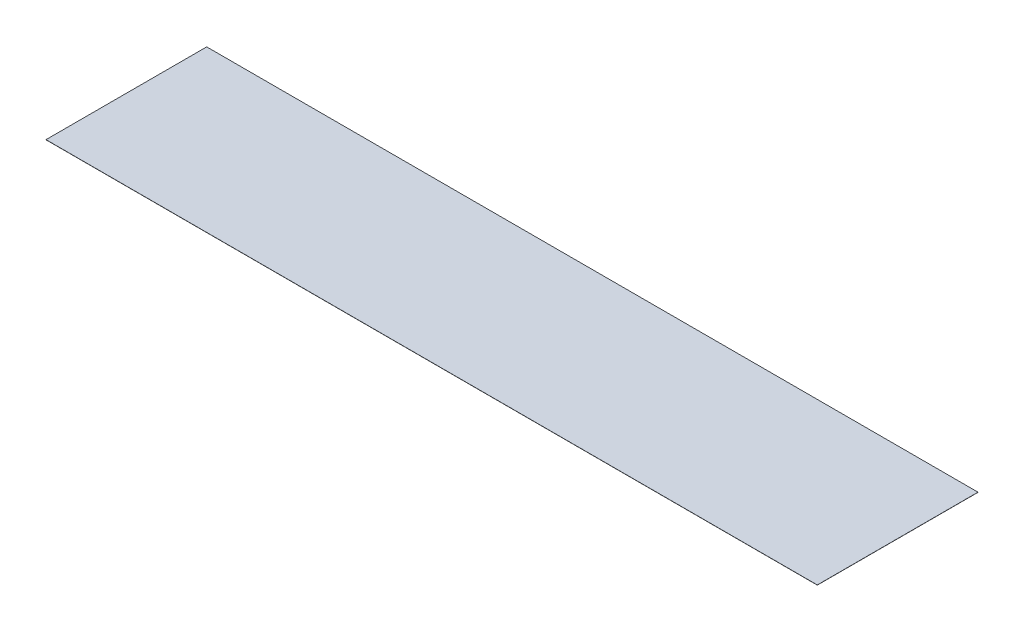
ISO-10303-21;
HEADER;
FILE_DESCRIPTION(('STEP AP214'),'2;1');
FILE_NAME('part.step','',(''),(''),'','','');
FILE_SCHEMA(('AUTOMOTIVE_DESIGN { 1 0 10303 214 1 1 1 1 }'));
ENDSEC;
DATA;
#1=APPLICATION_CONTEXT('core data for automotive mechanical design processes');
#2=APPLICATION_PROTOCOL_DEFINITION('international standard','automotive_design',2000,#1);
#3=PRODUCT_CONTEXT('',#1,'mechanical');
#4=PRODUCT('Part','Part','',(#3));
#5=PRODUCT_RELATED_PRODUCT_CATEGORY('part','',(#4));
#6=PRODUCT_DEFINITION_FORMATION('','',#4);
#7=PRODUCT_DEFINITION_CONTEXT('part definition',#1,'design');
#8=PRODUCT_DEFINITION('design','',#6,#7);
#9=PRODUCT_DEFINITION_SHAPE('','',#8);
#10=(LENGTH_UNIT() NAMED_UNIT(*) SI_UNIT(.MILLI.,.METRE.));
#11=(NAMED_UNIT(*) PLANE_ANGLE_UNIT() SI_UNIT($,.RADIAN.));
#12=(NAMED_UNIT(*) SI_UNIT($,.STERADIAN.) SOLID_ANGLE_UNIT());
#13=UNCERTAINTY_MEASURE_WITH_UNIT(LENGTH_MEASURE(1.E-05),#10,'distance_accuracy_value','');
#14=(GEOMETRIC_REPRESENTATION_CONTEXT(3) GLOBAL_UNCERTAINTY_ASSIGNED_CONTEXT((#13)) GLOBAL_UNIT_ASSIGNED_CONTEXT((#10,
#11,#12)) REPRESENTATION_CONTEXT('',''));
#15=CARTESIAN_POINT('',(0.,0.,0.));
#16=DIRECTION('',(0.,0.,1.));
#17=DIRECTION('',(1.,0.,0.));
#18=AXIS2_PLACEMENT_3D('',#15,#16,#17);
#19=CARTESIAN_POINT('',(-10972.8,4.7752,0.));
#20=DIRECTION('',(1.,0.,0.));
#21=DIRECTION('',(0.,0.,-1.));
#22=AXIS2_PLACEMENT_3D('',#19,#20,#21);
#23=PLANE('',#22);
#24=DIRECTION('',(0.,0.,1.));
#25=VECTOR('',#24,1.);
#26=CARTESIAN_POINT('',(-10972.8,0.,0.));
#27=LINE('',#26,#25);
#28=CARTESIAN_POINT('',(-10972.8,0.,-4572.));
#29=VERTEX_POINT('',#28);
#30=CARTESIAN_POINT('',(-10972.8,0.,0.));
#31=VERTEX_POINT('',#30);
#32=EDGE_CURVE('E103',#29,#31,#27,.T.);
#33=ORIENTED_EDGE('',*,*,#32,.T.);
#34=DIRECTION('',(0.,-1.,0.));
#35=VECTOR('',#34,1.);
#36=CARTESIAN_POINT('',(-10972.8,4.7752,0.));
#37=LINE('',#36,#35);
#38=CARTESIAN_POINT('',(-10972.8,4.7752,0.));
#39=VERTEX_POINT('',#38);
#40=EDGE_CURVE('E11',#39,#31,#37,.T.);
#41=ORIENTED_EDGE('',*,*,#40,.F.);
#42=DIRECTION('',(0.,0.,1.));
#43=VECTOR('',#42,1.);
#44=CARTESIAN_POINT('',(-10972.8,4.7752,0.));
#45=LINE('',#44,#43);
#46=CARTESIAN_POINT('',(-10972.8,4.7752,-4572.));
#47=VERTEX_POINT('',#46);
#48=EDGE_CURVE('E89',#47,#39,#45,.T.);
#49=ORIENTED_EDGE('',*,*,#48,.F.);
#50=DIRECTION('',(0.,-1.,0.));
#51=VECTOR('',#50,1.);
#52=CARTESIAN_POINT('',(-10972.8,4.7752,-4572.));
#53=LINE('',#52,#51);
#54=EDGE_CURVE('E99',#47,#29,#53,.T.);
#55=ORIENTED_EDGE('',*,*,#54,.T.);
#56=EDGE_LOOP('',(#33,#41,#49,#55));
#57=FACE_BOUND('',#56,.T.);
#58=ADVANCED_FACE('F38',(#57),#23,.F.);
#59=CARTESIAN_POINT('',(-10972.8,4.7752,0.));
#60=DIRECTION('',(0.,0.,-1.));
#61=DIRECTION('',(-1.,0.,0.));
#62=AXIS2_PLACEMENT_3D('',#59,#60,#61);
#63=PLANE('',#62);
#64=DIRECTION('',(1.,0.,0.));
#65=VECTOR('',#64,1.);
#66=CARTESIAN_POINT('',(-10972.8,0.,0.));
#67=LINE('',#66,#65);
#68=CARTESIAN_POINT('',(10972.8,0.,-4.03134131930522E-12));
#69=VERTEX_POINT('',#68);
#70=EDGE_CURVE('E94',#31,#69,#67,.T.);
#71=ORIENTED_EDGE('',*,*,#70,.T.);
#72=DIRECTION('',(0.,-1.,0.));
#73=VECTOR('',#72,1.);
#74=CARTESIAN_POINT('',(10972.8,4.7752,-4.03134131930522E-12));
#75=LINE('',#74,#73);
#76=CARTESIAN_POINT('',(10972.8,4.7752,-4.03134131930522E-12));
#77=VERTEX_POINT('',#76);
#78=EDGE_CURVE('E46',#77,#69,#75,.T.);
#79=ORIENTED_EDGE('',*,*,#78,.F.);
#80=DIRECTION('',(1.,0.,0.));
#81=VECTOR('',#80,1.);
#82=CARTESIAN_POINT('',(-10972.8,4.7752,0.));
#83=LINE('',#82,#81);
#84=EDGE_CURVE('E84',#39,#77,#83,.T.);
#85=ORIENTED_EDGE('',*,*,#84,.F.);
#86=ORIENTED_EDGE('',*,*,#40,.T.);
#87=EDGE_LOOP('',(#71,#79,#85,#86));
#88=FACE_BOUND('',#87,.T.);
#89=ADVANCED_FACE('F93',(#88),#63,.F.);
#90=CARTESIAN_POINT('',(10972.8,4.7752,-4.03134131930522E-12));
#91=DIRECTION('',(-1.,0.,0.));
#92=DIRECTION('',(0.,0.,1.));
#93=AXIS2_PLACEMENT_3D('',#90,#91,#92);
#94=PLANE('',#93);
#95=DIRECTION('',(0.,0.,-1.));
#96=VECTOR('',#95,1.);
#97=CARTESIAN_POINT('',(10972.8,0.,-4.03134131930522E-12));
#98=LINE('',#97,#96);
#99=CARTESIAN_POINT('',(10972.8,0.,-4572.));
#100=VERTEX_POINT('',#99);
#101=EDGE_CURVE('E71',#69,#100,#98,.T.);
#102=ORIENTED_EDGE('',*,*,#101,.T.);
#103=DIRECTION('',(0.,-1.,0.));
#104=VECTOR('',#103,1.);
#105=CARTESIAN_POINT('',(10972.8,4.7752,-4572.));
#106=LINE('',#105,#104);
#107=CARTESIAN_POINT('',(10972.8,4.7752,-4572.));
#108=VERTEX_POINT('',#107);
#109=EDGE_CURVE('E95',#108,#100,#106,.T.);
#110=ORIENTED_EDGE('',*,*,#109,.F.);
#111=DIRECTION('',(0.,0.,-1.));
#112=VECTOR('',#111,1.);
#113=CARTESIAN_POINT('',(10972.8,4.7752,-4.03134131930522E-12));
#114=LINE('',#113,#112);
#115=EDGE_CURVE('E87',#77,#108,#114,.T.);
#116=ORIENTED_EDGE('',*,*,#115,.F.);
#117=ORIENTED_EDGE('',*,*,#78,.T.);
#118=EDGE_LOOP('',(#102,#110,#116,#117));
#119=FACE_BOUND('',#118,.T.);
#120=ADVANCED_FACE('F96',(#119),#94,.F.);
#121=CARTESIAN_POINT('',(-10972.8,4.7752,-4572.));
#122=DIRECTION('',(0.,0.,1.));
#123=DIRECTION('',(1.,0.,0.));
#124=AXIS2_PLACEMENT_3D('',#121,#122,#123);
#125=PLANE('',#124);
#126=DIRECTION('',(-1.,0.,0.));
#127=VECTOR('',#126,1.);
#128=CARTESIAN_POINT('',(-10972.8,0.,-4572.));
#129=LINE('',#128,#127);
#130=EDGE_CURVE('E77',#100,#29,#129,.T.);
#131=ORIENTED_EDGE('',*,*,#130,.T.);
#132=ORIENTED_EDGE('',*,*,#54,.F.);
#133=DIRECTION('',(-1.,0.,0.));
#134=VECTOR('',#133,1.);
#135=CARTESIAN_POINT('',(-10972.8,4.7752,-4572.));
#136=LINE('',#135,#134);
#137=EDGE_CURVE('E54',#108,#47,#136,.T.);
#138=ORIENTED_EDGE('',*,*,#137,.F.);
#139=ORIENTED_EDGE('',*,*,#109,.T.);
#140=EDGE_LOOP('',(#131,#132,#138,#139));
#141=FACE_BOUND('',#140,.T.);
#142=ADVANCED_FACE('F112',(#141),#125,.F.);
#143=CARTESIAN_POINT('',(0.,4.7752,0.));
#144=DIRECTION('',(0.,-1.,0.));
#145=DIRECTION('',(0.,0.,-1.));
#146=AXIS2_PLACEMENT_3D('',#143,#144,#145);
#147=PLANE('',#146);
#148=ORIENTED_EDGE('',*,*,#48,.T.);
#149=ORIENTED_EDGE('',*,*,#84,.T.);
#150=ORIENTED_EDGE('',*,*,#115,.T.);
#151=ORIENTED_EDGE('',*,*,#137,.T.);
#152=EDGE_LOOP('',(#148,#149,#150,#151));
#153=FACE_BOUND('',#152,.T.);
#154=ADVANCED_FACE('F85',(#153),#147,.F.);
#155=CARTESIAN_POINT('',(0.,0.,0.));
#156=DIRECTION('',(0.,-1.,0.));
#157=DIRECTION('',(0.,0.,-1.));
#158=AXIS2_PLACEMENT_3D('',#155,#156,#157);
#159=PLANE('',#158);
#160=ORIENTED_EDGE('',*,*,#32,.F.);
#161=ORIENTED_EDGE('',*,*,#130,.F.);
#162=ORIENTED_EDGE('',*,*,#101,.F.);
#163=ORIENTED_EDGE('',*,*,#70,.F.);
#164=EDGE_LOOP('',(#160,#161,#162,#163));
#165=FACE_BOUND('',#164,.T.);
#166=ADVANCED_FACE('F115',(#165),#159,.T.);
#167=CLOSED_SHELL('',(#58,#89,#120,#142,#154,#166));
#168=MANIFOLD_SOLID_BREP('B2',#167);
#169=ADVANCED_BREP_SHAPE_REPRESENTATION('',(#18,#168),#14);
#170=SHAPE_DEFINITION_REPRESENTATION(#9,#169);
ENDSEC;
END-ISO-10303-21;
